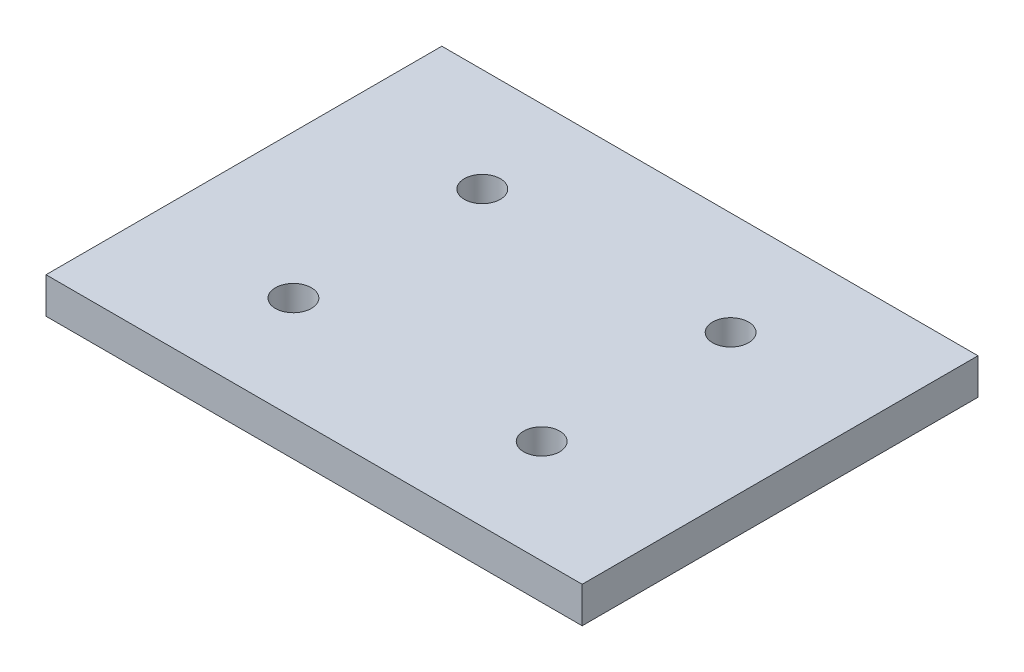
ISO-10303-21;
HEADER;
FILE_DESCRIPTION(('STEP AP214'),'2;1');
FILE_NAME('part.step','',(''),(''),'','','');
FILE_SCHEMA(('AUTOMOTIVE_DESIGN { 1 0 10303 214 1 1 1 1 }'));
ENDSEC;
DATA;
#1=APPLICATION_CONTEXT('core data for automotive mechanical design processes');
#2=APPLICATION_PROTOCOL_DEFINITION('international standard','automotive_design',2000,#1);
#3=PRODUCT_CONTEXT('',#1,'mechanical');
#4=PRODUCT('Part','Part','',(#3));
#5=PRODUCT_RELATED_PRODUCT_CATEGORY('part','',(#4));
#6=PRODUCT_DEFINITION_FORMATION('','',#4);
#7=PRODUCT_DEFINITION_CONTEXT('part definition',#1,'design');
#8=PRODUCT_DEFINITION('design','',#6,#7);
#9=PRODUCT_DEFINITION_SHAPE('','',#8);
#10=(LENGTH_UNIT() NAMED_UNIT(*) SI_UNIT(.MILLI.,.METRE.));
#11=(NAMED_UNIT(*) PLANE_ANGLE_UNIT() SI_UNIT($,.RADIAN.));
#12=(NAMED_UNIT(*) SI_UNIT($,.STERADIAN.) SOLID_ANGLE_UNIT());
#13=UNCERTAINTY_MEASURE_WITH_UNIT(LENGTH_MEASURE(1.E-05),#10,'distance_accuracy_value','');
#14=(GEOMETRIC_REPRESENTATION_CONTEXT(3) GLOBAL_UNCERTAINTY_ASSIGNED_CONTEXT((#13)) GLOBAL_UNIT_ASSIGNED_CONTEXT((#10,
#11,#12)) REPRESENTATION_CONTEXT('',''));
#15=CARTESIAN_POINT('',(0.,0.,0.));
#16=DIRECTION('',(0.,0.,1.));
#17=DIRECTION('',(1.,0.,0.));
#18=AXIS2_PLACEMENT_3D('',#15,#16,#17);
#19=CARTESIAN_POINT('',(14.9,2.,11.));
#20=DIRECTION('',(-1.,0.,0.));
#21=DIRECTION('',(0.,0.,1.));
#22=AXIS2_PLACEMENT_3D('',#19,#20,#21);
#23=PLANE('',#22);
#24=DIRECTION('',(0.,0.,-1.));
#25=VECTOR('',#24,1.);
#26=CARTESIAN_POINT('',(14.9,0.,11.));
#27=LINE('',#26,#25);
#28=CARTESIAN_POINT('',(14.9,0.,11.));
#29=VERTEX_POINT('',#28);
#30=CARTESIAN_POINT('',(14.9,0.,-11.));
#31=VERTEX_POINT('',#30);
#32=EDGE_CURVE('E99',#29,#31,#27,.T.);
#33=ORIENTED_EDGE('',*,*,#32,.T.);
#34=DIRECTION('',(0.,-1.,0.));
#35=VECTOR('',#34,1.);
#36=CARTESIAN_POINT('',(14.9,2.,-11.));
#37=LINE('',#36,#35);
#38=CARTESIAN_POINT('',(14.9,2.,-11.));
#39=VERTEX_POINT('',#38);
#40=EDGE_CURVE('E11',#39,#31,#37,.T.);
#41=ORIENTED_EDGE('',*,*,#40,.F.);
#42=DIRECTION('',(0.,0.,-1.));
#43=VECTOR('',#42,1.);
#44=CARTESIAN_POINT('',(14.9,2.,11.));
#45=LINE('',#44,#43);
#46=CARTESIAN_POINT('',(14.9,2.,11.));
#47=VERTEX_POINT('',#46);
#48=EDGE_CURVE('E87',#47,#39,#45,.T.);
#49=ORIENTED_EDGE('',*,*,#48,.F.);
#50=DIRECTION('',(0.,-1.,0.));
#51=VECTOR('',#50,1.);
#52=CARTESIAN_POINT('',(14.9,2.,11.));
#53=LINE('',#52,#51);
#54=EDGE_CURVE('E95',#47,#29,#53,.T.);
#55=ORIENTED_EDGE('',*,*,#54,.T.);
#56=EDGE_LOOP('',(#33,#41,#49,#55));
#57=FACE_BOUND('',#56,.T.);
#58=ADVANCED_FACE('F36',(#57),#23,.F.);
#59=CARTESIAN_POINT('',(-14.9,2.,-11.));
#60=DIRECTION('',(0.,0.,1.));
#61=DIRECTION('',(1.,0.,0.));
#62=AXIS2_PLACEMENT_3D('',#59,#60,#61);
#63=PLANE('',#62);
#64=DIRECTION('',(-1.,0.,0.));
#65=VECTOR('',#64,1.);
#66=CARTESIAN_POINT('',(-14.9,0.,-11.));
#67=LINE('',#66,#65);
#68=CARTESIAN_POINT('',(-14.9,0.,-11.));
#69=VERTEX_POINT('',#68);
#70=EDGE_CURVE('E91',#31,#69,#67,.T.);
#71=ORIENTED_EDGE('',*,*,#70,.T.);
#72=DIRECTION('',(0.,-1.,0.));
#73=VECTOR('',#72,1.);
#74=CARTESIAN_POINT('',(-14.9,2.,-11.));
#75=LINE('',#74,#73);
#76=CARTESIAN_POINT('',(-14.9,2.,-11.));
#77=VERTEX_POINT('',#76);
#78=EDGE_CURVE('E44',#77,#69,#75,.T.);
#79=ORIENTED_EDGE('',*,*,#78,.F.);
#80=DIRECTION('',(-1.,0.,0.));
#81=VECTOR('',#80,1.);
#82=CARTESIAN_POINT('',(-14.9,2.,-11.));
#83=LINE('',#82,#81);
#84=EDGE_CURVE('E82',#39,#77,#83,.T.);
#85=ORIENTED_EDGE('',*,*,#84,.F.);
#86=ORIENTED_EDGE('',*,*,#40,.T.);
#87=EDGE_LOOP('',(#71,#79,#85,#86));
#88=FACE_BOUND('',#87,.T.);
#89=ADVANCED_FACE('F90',(#88),#63,.F.);
#90=CARTESIAN_POINT('',(-14.9,2.,11.));
#91=DIRECTION('',(1.,0.,0.));
#92=DIRECTION('',(0.,0.,-1.));
#93=AXIS2_PLACEMENT_3D('',#90,#91,#92);
#94=PLANE('',#93);
#95=DIRECTION('',(0.,0.,1.));
#96=VECTOR('',#95,1.);
#97=CARTESIAN_POINT('',(-14.9,0.,11.));
#98=LINE('',#97,#96);
#99=CARTESIAN_POINT('',(-14.9,0.,11.));
#100=VERTEX_POINT('',#99);
#101=EDGE_CURVE('E69',#69,#100,#98,.T.);
#102=ORIENTED_EDGE('',*,*,#101,.T.);
#103=DIRECTION('',(0.,-1.,0.));
#104=VECTOR('',#103,1.);
#105=CARTESIAN_POINT('',(-14.9,2.,11.));
#106=LINE('',#105,#104);
#107=CARTESIAN_POINT('',(-14.9,2.,11.));
#108=VERTEX_POINT('',#107);
#109=EDGE_CURVE('E92',#108,#100,#106,.T.);
#110=ORIENTED_EDGE('',*,*,#109,.F.);
#111=DIRECTION('',(0.,0.,1.));
#112=VECTOR('',#111,1.);
#113=CARTESIAN_POINT('',(-14.9,2.,11.));
#114=LINE('',#113,#112);
#115=EDGE_CURVE('E85',#77,#108,#114,.T.);
#116=ORIENTED_EDGE('',*,*,#115,.F.);
#117=ORIENTED_EDGE('',*,*,#78,.T.);
#118=EDGE_LOOP('',(#102,#110,#116,#117));
#119=FACE_BOUND('',#118,.T.);
#120=ADVANCED_FACE('F93',(#119),#94,.F.);
#121=CARTESIAN_POINT('',(-14.9,2.,11.));
#122=DIRECTION('',(0.,0.,-1.));
#123=DIRECTION('',(-1.,0.,0.));
#124=AXIS2_PLACEMENT_3D('',#121,#122,#123);
#125=PLANE('',#124);
#126=DIRECTION('',(1.,0.,0.));
#127=VECTOR('',#126,1.);
#128=CARTESIAN_POINT('',(-14.9,0.,11.));
#129=LINE('',#128,#127);
#130=EDGE_CURVE('E75',#100,#29,#129,.T.);
#131=ORIENTED_EDGE('',*,*,#130,.T.);
#132=ORIENTED_EDGE('',*,*,#54,.F.);
#133=DIRECTION('',(1.,0.,0.));
#134=VECTOR('',#133,1.);
#135=CARTESIAN_POINT('',(-14.9,2.,11.));
#136=LINE('',#135,#134);
#137=EDGE_CURVE('E52',#108,#47,#136,.T.);
#138=ORIENTED_EDGE('',*,*,#137,.F.);
#139=ORIENTED_EDGE('',*,*,#109,.T.);
#140=EDGE_LOOP('',(#131,#132,#138,#139));
#141=FACE_BOUND('',#140,.T.);
#142=ADVANCED_FACE('F107',(#141),#125,.F.);
#143=CARTESIAN_POINT('',(0.,2.,0.));
#144=DIRECTION('',(0.,-1.,0.));
#145=DIRECTION('',(0.,0.,-1.));
#146=AXIS2_PLACEMENT_3D('',#143,#144,#145);
#147=PLANE('',#146);
#148=CARTESIAN_POINT('',(-6.9,2.,5.25));
#149=DIRECTION('',(0.,-1.,0.));
#150=DIRECTION('',(0.,0.,-1.));
#151=AXIS2_PLACEMENT_3D('',#148,#149,#150);
#152=CIRCLE('',#151,1.);
#153=CARTESIAN_POINT('',(-6.9,2.,4.25));
#154=VERTEX_POINT('',#153);
#155=EDGE_CURVE('E130',#154,#154,#152,.F.);
#156=ORIENTED_EDGE('',*,*,#155,.F.);
#157=EDGE_LOOP('',(#156));
#158=FACE_BOUND('',#157,.T.);
#159=CARTESIAN_POINT('',(6.9,2.,5.25));
#160=DIRECTION('',(0.,-1.,0.));
#161=DIRECTION('',(0.,0.,-1.));
#162=AXIS2_PLACEMENT_3D('',#159,#160,#161);
#163=CIRCLE('',#162,1.);
#164=CARTESIAN_POINT('',(6.9,2.,4.25));
#165=VERTEX_POINT('',#164);
#166=EDGE_CURVE('E124',#165,#165,#163,.F.);
#167=ORIENTED_EDGE('',*,*,#166,.F.);
#168=EDGE_LOOP('',(#167));
#169=FACE_BOUND('',#168,.T.);
#170=CARTESIAN_POINT('',(-6.9,2.,-5.25));
#171=DIRECTION('',(0.,-1.,0.));
#172=DIRECTION('',(0.,0.,-1.));
#173=AXIS2_PLACEMENT_3D('',#170,#171,#172);
#174=CIRCLE('',#173,1.);
#175=CARTESIAN_POINT('',(-6.9,2.,-6.25));
#176=VERTEX_POINT('',#175);
#177=EDGE_CURVE('E118',#176,#176,#174,.T.);
#178=ORIENTED_EDGE('',*,*,#177,.T.);
#179=EDGE_LOOP('',(#178));
#180=FACE_BOUND('',#179,.T.);
#181=CARTESIAN_POINT('',(6.9,2.,-5.25));
#182=DIRECTION('',(0.,-1.,0.));
#183=DIRECTION('',(0.,0.,-1.));
#184=AXIS2_PLACEMENT_3D('',#181,#182,#183);
#185=CIRCLE('',#184,1.);
#186=CARTESIAN_POINT('',(6.9,2.,-6.25));
#187=VERTEX_POINT('',#186);
#188=EDGE_CURVE('E102',#187,#187,#185,.T.);
#189=ORIENTED_EDGE('',*,*,#188,.T.);
#190=EDGE_LOOP('',(#189));
#191=FACE_BOUND('',#190,.T.);
#192=ORIENTED_EDGE('',*,*,#48,.T.);
#193=ORIENTED_EDGE('',*,*,#84,.T.);
#194=ORIENTED_EDGE('',*,*,#115,.T.);
#195=ORIENTED_EDGE('',*,*,#137,.T.);
#196=EDGE_LOOP('',(#192,#193,#194,#195));
#197=FACE_BOUND('',#196,.T.);
#198=ADVANCED_FACE('F83',(#158,#169,#180,#191,#197),#147,.F.);
#199=CARTESIAN_POINT('',(0.,0.,0.));
#200=DIRECTION('',(0.,-1.,0.));
#201=DIRECTION('',(0.,0.,-1.));
#202=AXIS2_PLACEMENT_3D('',#199,#200,#201);
#203=PLANE('',#202);
#204=CARTESIAN_POINT('',(-6.9,0.,5.25));
#205=DIRECTION('',(0.,1.,0.));
#206=DIRECTION('',(0.,0.,1.));
#207=AXIS2_PLACEMENT_3D('',#204,#205,#206);
#208=CIRCLE('',#207,1.);
#209=CARTESIAN_POINT('',(-6.9,0.,6.25));
#210=VERTEX_POINT('',#209);
#211=EDGE_CURVE('E133',#210,#210,#208,.T.);
#212=ORIENTED_EDGE('',*,*,#211,.T.);
#213=EDGE_LOOP('',(#212));
#214=FACE_BOUND('',#213,.T.);
#215=CARTESIAN_POINT('',(6.9,0.,5.25));
#216=DIRECTION('',(0.,1.,0.));
#217=DIRECTION('',(0.,0.,1.));
#218=AXIS2_PLACEMENT_3D('',#215,#216,#217);
#219=CIRCLE('',#218,1.);
#220=CARTESIAN_POINT('',(6.9,0.,6.25));
#221=VERTEX_POINT('',#220);
#222=EDGE_CURVE('E127',#221,#221,#219,.T.);
#223=ORIENTED_EDGE('',*,*,#222,.T.);
#224=EDGE_LOOP('',(#223));
#225=FACE_BOUND('',#224,.T.);
#226=CARTESIAN_POINT('',(-6.9,0.,-5.25));
#227=DIRECTION('',(0.,-1.,0.));
#228=DIRECTION('',(0.,0.,-1.));
#229=AXIS2_PLACEMENT_3D('',#226,#227,#228);
#230=CIRCLE('',#229,1.);
#231=CARTESIAN_POINT('',(-6.9,0.,-6.25));
#232=VERTEX_POINT('',#231);
#233=EDGE_CURVE('E121',#232,#232,#230,.T.);
#234=ORIENTED_EDGE('',*,*,#233,.F.);
#235=EDGE_LOOP('',(#234));
#236=FACE_BOUND('',#235,.T.);
#237=CARTESIAN_POINT('',(6.9,0.,-5.25));
#238=DIRECTION('',(0.,-1.,0.));
#239=DIRECTION('',(0.,0.,-1.));
#240=AXIS2_PLACEMENT_3D('',#237,#238,#239);
#241=CIRCLE('',#240,1.);
#242=CARTESIAN_POINT('',(6.9,0.,-6.25));
#243=VERTEX_POINT('',#242);
#244=EDGE_CURVE('E115',#243,#243,#241,.T.);
#245=ORIENTED_EDGE('',*,*,#244,.F.);
#246=EDGE_LOOP('',(#245));
#247=FACE_BOUND('',#246,.T.);
#248=ORIENTED_EDGE('',*,*,#32,.F.);
#249=ORIENTED_EDGE('',*,*,#130,.F.);
#250=ORIENTED_EDGE('',*,*,#101,.F.);
#251=ORIENTED_EDGE('',*,*,#70,.F.);
#252=EDGE_LOOP('',(#248,#249,#250,#251));
#253=FACE_BOUND('',#252,.T.);
#254=ADVANCED_FACE('F110',(#214,#225,#236,#247,#253),#203,.T.);
#255=CARTESIAN_POINT('',(6.9,10.,-5.25));
#256=DIRECTION('',(0.,-1.,0.));
#257=DIRECTION('',(0.,0.,-1.));
#258=AXIS2_PLACEMENT_3D('',#255,#256,#257);
#259=CYLINDRICAL_SURFACE('',#258,1.);
#260=ORIENTED_EDGE('',*,*,#244,.T.);
#261=EDGE_LOOP('',(#260));
#262=FACE_BOUND('',#261,.T.);
#263=ORIENTED_EDGE('',*,*,#188,.F.);
#264=EDGE_LOOP('',(#263));
#265=FACE_BOUND('',#264,.T.);
#266=ADVANCED_FACE('F155',(#262,#265),#259,.F.);
#267=CARTESIAN_POINT('',(-6.9,10.,-5.25));
#268=DIRECTION('',(0.,-1.,0.));
#269=DIRECTION('',(0.,0.,-1.));
#270=AXIS2_PLACEMENT_3D('',#267,#268,#269);
#271=CYLINDRICAL_SURFACE('',#270,1.);
#272=ORIENTED_EDGE('',*,*,#233,.T.);
#273=EDGE_LOOP('',(#272));
#274=FACE_BOUND('',#273,.T.);
#275=ORIENTED_EDGE('',*,*,#177,.F.);
#276=EDGE_LOOP('',(#275));
#277=FACE_BOUND('',#276,.T.);
#278=ADVANCED_FACE('F157',(#274,#277),#271,.F.);
#279=CARTESIAN_POINT('',(6.9,10.,5.25));
#280=DIRECTION('',(0.,-1.,0.));
#281=DIRECTION('',(0.,0.,-1.));
#282=AXIS2_PLACEMENT_3D('',#279,#280,#281);
#283=CYLINDRICAL_SURFACE('',#282,1.);
#284=ORIENTED_EDGE('',*,*,#222,.F.);
#285=EDGE_LOOP('',(#284));
#286=FACE_BOUND('',#285,.T.);
#287=ORIENTED_EDGE('',*,*,#166,.T.);
#288=EDGE_LOOP('',(#287));
#289=FACE_BOUND('',#288,.T.);
#290=ADVANCED_FACE('F142',(#286,#289),#283,.F.);
#291=CARTESIAN_POINT('',(-6.9,10.,5.25));
#292=DIRECTION('',(0.,-1.,0.));
#293=DIRECTION('',(0.,0.,-1.));
#294=AXIS2_PLACEMENT_3D('',#291,#292,#293);
#295=CYLINDRICAL_SURFACE('',#294,1.);
#296=ORIENTED_EDGE('',*,*,#211,.F.);
#297=EDGE_LOOP('',(#296));
#298=FACE_BOUND('',#297,.T.);
#299=ORIENTED_EDGE('',*,*,#155,.T.);
#300=EDGE_LOOP('',(#299));
#301=FACE_BOUND('',#300,.T.);
#302=ADVANCED_FACE('F139',(#298,#301),#295,.F.);
#303=CLOSED_SHELL('',(#58,#89,#120,#142,#198,#254,#266,#278,#290,#302));
#304=MANIFOLD_SOLID_BREP('B2',#303);
#305=ADVANCED_BREP_SHAPE_REPRESENTATION('',(#18,#304),#14);
#306=SHAPE_DEFINITION_REPRESENTATION(#9,#305);
ENDSEC;
END-ISO-10303-21;
